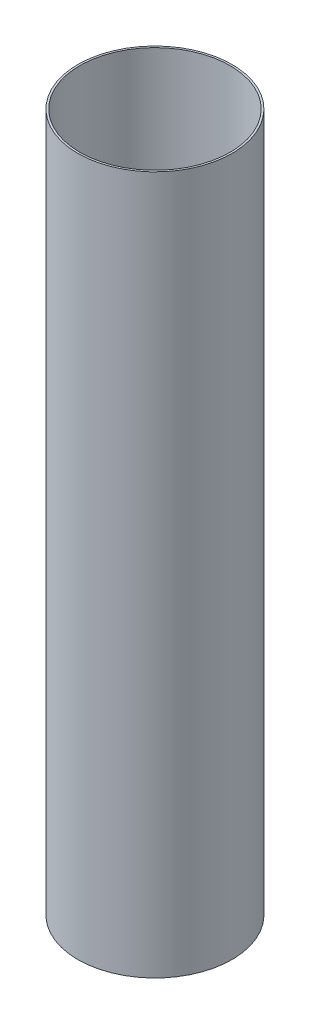
ISO-10303-21;
HEADER;
FILE_DESCRIPTION(('STEP AP214'),'2;1');
FILE_NAME('part.step','',(''),(''),'','','');
FILE_SCHEMA(('AUTOMOTIVE_DESIGN { 1 0 10303 214 1 1 1 1 }'));
ENDSEC;
DATA;
#1=APPLICATION_CONTEXT('core data for automotive mechanical design processes');
#2=APPLICATION_PROTOCOL_DEFINITION('international standard','automotive_design',2000,#1);
#3=PRODUCT_CONTEXT('',#1,'mechanical');
#4=PRODUCT('Part','Part','',(#3));
#5=PRODUCT_RELATED_PRODUCT_CATEGORY('part','',(#4));
#6=PRODUCT_DEFINITION_FORMATION('','',#4);
#7=PRODUCT_DEFINITION_CONTEXT('part definition',#1,'design');
#8=PRODUCT_DEFINITION('design','',#6,#7);
#9=PRODUCT_DEFINITION_SHAPE('','',#8);
#10=(LENGTH_UNIT() NAMED_UNIT(*) SI_UNIT(.MILLI.,.METRE.));
#11=(NAMED_UNIT(*) PLANE_ANGLE_UNIT() SI_UNIT($,.RADIAN.));
#12=(NAMED_UNIT(*) SI_UNIT($,.STERADIAN.) SOLID_ANGLE_UNIT());
#13=UNCERTAINTY_MEASURE_WITH_UNIT(LENGTH_MEASURE(1.E-05),#10,'distance_accuracy_value','');
#14=(GEOMETRIC_REPRESENTATION_CONTEXT(3) GLOBAL_UNCERTAINTY_ASSIGNED_CONTEXT((#13)) GLOBAL_UNIT_ASSIGNED_CONTEXT((#10,
#11,#12)) REPRESENTATION_CONTEXT('',''));
#15=CARTESIAN_POINT('',(0.,0.,0.));
#16=DIRECTION('',(0.,0.,1.));
#17=DIRECTION('',(1.,0.,0.));
#18=AXIS2_PLACEMENT_3D('',#15,#16,#17);
#19=CARTESIAN_POINT('',(0.,914.4,0.));
#20=DIRECTION('',(0.,1.,0.));
#21=DIRECTION('',(0.,0.,1.));
#22=AXIS2_PLACEMENT_3D('',#19,#20,#21);
#23=PLANE('',#22);
#24=CARTESIAN_POINT('',(0.,914.4,0.));
#25=DIRECTION('',(0.,1.,0.));
#26=DIRECTION('',(0.,0.,1.));
#27=AXIS2_PLACEMENT_3D('',#24,#25,#26);
#28=CIRCLE('',#27,100.965);
#29=CARTESIAN_POINT('',(0.,914.4,100.965));
#30=VERTEX_POINT('',#29);
#31=EDGE_CURVE('E10',#30,#30,#28,.T.);
#32=ORIENTED_EDGE('',*,*,#31,.T.);
#33=EDGE_LOOP('',(#32));
#34=FACE_BOUND('',#33,.T.);
#35=CARTESIAN_POINT('',(0.,914.4,0.));
#36=DIRECTION('',(0.,1.,0.));
#37=DIRECTION('',(0.,0.,1.));
#38=AXIS2_PLACEMENT_3D('',#35,#36,#37);
#39=CIRCLE('',#38,98.425);
#40=CARTESIAN_POINT('',(0.,914.4,98.425));
#41=VERTEX_POINT('',#40);
#42=EDGE_CURVE('E52',#41,#41,#39,.T.);
#43=ORIENTED_EDGE('',*,*,#42,.F.);
#44=EDGE_LOOP('',(#43));
#45=FACE_BOUND('',#44,.T.);
#46=ADVANCED_FACE('F39',(#34,#45),#23,.T.);
#47=CARTESIAN_POINT('',(0.,0.,0.));
#48=DIRECTION('',(0.,1.,0.));
#49=DIRECTION('',(0.,0.,1.));
#50=AXIS2_PLACEMENT_3D('',#47,#48,#49);
#51=PLANE('',#50);
#52=CARTESIAN_POINT('',(0.,0.,0.));
#53=DIRECTION('',(0.,1.,0.));
#54=DIRECTION('',(0.,0.,1.));
#55=AXIS2_PLACEMENT_3D('',#52,#53,#54);
#56=CIRCLE('',#55,100.965);
#57=CARTESIAN_POINT('',(0.,0.,100.965));
#58=VERTEX_POINT('',#57);
#59=EDGE_CURVE('E43',#58,#58,#56,.T.);
#60=ORIENTED_EDGE('',*,*,#59,.F.);
#61=EDGE_LOOP('',(#60));
#62=FACE_BOUND('',#61,.T.);
#63=CARTESIAN_POINT('',(0.,0.,0.));
#64=DIRECTION('',(0.,1.,0.));
#65=DIRECTION('',(0.,0.,1.));
#66=AXIS2_PLACEMENT_3D('',#63,#64,#65);
#67=CIRCLE('',#66,98.425);
#68=CARTESIAN_POINT('',(0.,0.,98.425));
#69=VERTEX_POINT('',#68);
#70=EDGE_CURVE('E54',#69,#69,#67,.T.);
#71=ORIENTED_EDGE('',*,*,#70,.T.);
#72=EDGE_LOOP('',(#71));
#73=FACE_BOUND('',#72,.T.);
#74=ADVANCED_FACE('F66',(#62,#73),#51,.F.);
#75=CARTESIAN_POINT('',(0.,914.4,0.));
#76=DIRECTION('',(0.,-1.,0.));
#77=DIRECTION('',(0.,0.,-1.));
#78=AXIS2_PLACEMENT_3D('',#75,#76,#77);
#79=CYLINDRICAL_SURFACE('',#78,100.965);
#80=ORIENTED_EDGE('',*,*,#31,.F.);
#81=EDGE_LOOP('',(#80));
#82=FACE_BOUND('',#81,.T.);
#83=ORIENTED_EDGE('',*,*,#59,.T.);
#84=EDGE_LOOP('',(#83));
#85=FACE_BOUND('',#84,.T.);
#86=ADVANCED_FACE('F41',(#82,#85),#79,.T.);
#87=CARTESIAN_POINT('',(0.,914.4,0.));
#88=DIRECTION('',(0.,-1.,0.));
#89=DIRECTION('',(0.,0.,-1.));
#90=AXIS2_PLACEMENT_3D('',#87,#88,#89);
#91=CYLINDRICAL_SURFACE('',#90,98.425);
#92=ORIENTED_EDGE('',*,*,#42,.T.);
#93=EDGE_LOOP('',(#92));
#94=FACE_BOUND('',#93,.T.);
#95=ORIENTED_EDGE('',*,*,#70,.F.);
#96=EDGE_LOOP('',(#95));
#97=FACE_BOUND('',#96,.T.);
#98=ADVANCED_FACE('F62',(#94,#97),#91,.F.);
#99=CLOSED_SHELL('',(#46,#74,#86,#98));
#100=MANIFOLD_SOLID_BREP('B2',#99);
#101=ADVANCED_BREP_SHAPE_REPRESENTATION('',(#18,#100),#14);
#102=SHAPE_DEFINITION_REPRESENTATION(#9,#101);
ENDSEC;
END-ISO-10303-21;
